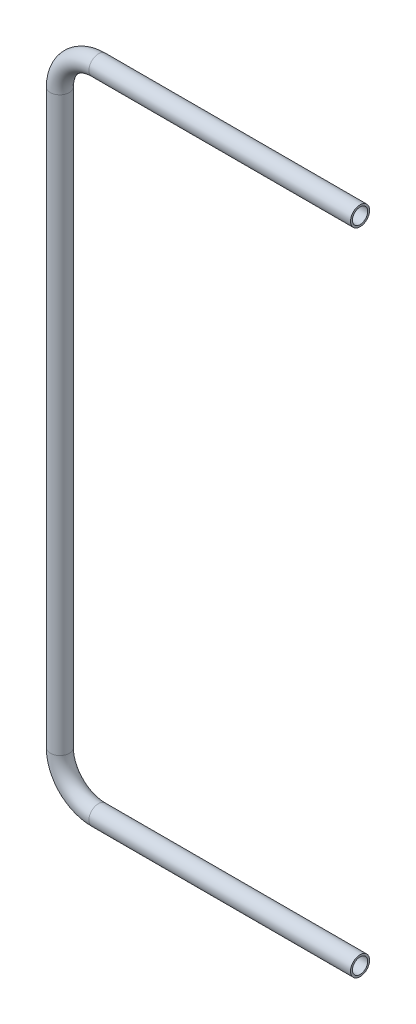
ISO-10303-21;
HEADER;
FILE_DESCRIPTION(('STEP AP214'),'2;1');
FILE_NAME('part.step','',(''),(''),'','','');
FILE_SCHEMA(('AUTOMOTIVE_DESIGN { 1 0 10303 214 1 1 1 1 }'));
ENDSEC;
DATA;
#1=APPLICATION_CONTEXT('core data for automotive mechanical design processes');
#2=APPLICATION_PROTOCOL_DEFINITION('international standard','automotive_design',2000,#1);
#3=PRODUCT_CONTEXT('',#1,'mechanical');
#4=PRODUCT('Part','Part','',(#3));
#5=PRODUCT_RELATED_PRODUCT_CATEGORY('part','',(#4));
#6=PRODUCT_DEFINITION_FORMATION('','',#4);
#7=PRODUCT_DEFINITION_CONTEXT('part definition',#1,'design');
#8=PRODUCT_DEFINITION('design','',#6,#7);
#9=PRODUCT_DEFINITION_SHAPE('','',#8);
#10=(LENGTH_UNIT() NAMED_UNIT(*) SI_UNIT(.MILLI.,.METRE.));
#11=(NAMED_UNIT(*) PLANE_ANGLE_UNIT() SI_UNIT($,.RADIAN.));
#12=(NAMED_UNIT(*) SI_UNIT($,.STERADIAN.) SOLID_ANGLE_UNIT());
#13=UNCERTAINTY_MEASURE_WITH_UNIT(LENGTH_MEASURE(1.E-05),#10,'distance_accuracy_value','');
#14=(GEOMETRIC_REPRESENTATION_CONTEXT(3) GLOBAL_UNCERTAINTY_ASSIGNED_CONTEXT((#13)) GLOBAL_UNIT_ASSIGNED_CONTEXT((#10,
#11,#12)) REPRESENTATION_CONTEXT('',''));
#15=CARTESIAN_POINT('',(0.,0.,0.));
#16=DIRECTION('',(0.,0.,1.));
#17=DIRECTION('',(1.,0.,0.));
#18=AXIS2_PLACEMENT_3D('',#15,#16,#17);
#19=CARTESIAN_POINT('',(0.,0.,0.));
#20=DIRECTION('',(-1.,0.,0.));
#21=DIRECTION('',(0.,-1.,0.));
#22=AXIS2_PLACEMENT_3D('',#19,#20,#21);
#23=CYLINDRICAL_SURFACE('',#22,16.7005);
#24=CARTESIAN_POINT('',(-457.2,0.,0.));
#25=DIRECTION('',(1.,0.,0.));
#26=DIRECTION('',(0.,0.,-1.));
#27=AXIS2_PLACEMENT_3D('',#24,#25,#26);
#28=CIRCLE('',#27,16.7005);
#29=CARTESIAN_POINT('',(-457.2,-16.7005000000001,0.));
#30=VERTEX_POINT('',#29);
#31=EDGE_CURVE('E116',#30,#30,#28,.T.);
#32=ORIENTED_EDGE('',*,*,#31,.T.);
#33=EDGE_LOOP('',(#32));
#34=FACE_BOUND('',#33,.T.);
#35=CARTESIAN_POINT('',(0.,0.,0.));
#36=DIRECTION('',(1.,0.,0.));
#37=DIRECTION('',(0.,0.,-1.));
#38=AXIS2_PLACEMENT_3D('',#35,#36,#37);
#39=CIRCLE('',#38,16.7005);
#40=CARTESIAN_POINT('',(0.,0.,-16.7005));
#41=VERTEX_POINT('',#40);
#42=EDGE_CURVE('E50',#41,#41,#39,.T.);
#43=ORIENTED_EDGE('',*,*,#42,.F.);
#44=EDGE_LOOP('',(#43));
#45=FACE_BOUND('',#44,.T.);
#46=ADVANCED_FACE('F35',(#34,#45),#23,.T.);
#47=CARTESIAN_POINT('',(-457.2,67.5005,0.));
#48=DIRECTION('',(0.,0.,-1.));
#49=DIRECTION('',(-1.,0.,0.));
#50=AXIS2_PLACEMENT_3D('',#47,#48,#49);
#51=TOROIDAL_SURFACE('',#50,67.5005,16.7005);
#52=CARTESIAN_POINT('',(-524.7005,67.5005,0.));
#53=DIRECTION('',(0.,-1.,0.));
#54=DIRECTION('',(0.,0.,-1.));
#55=AXIS2_PLACEMENT_3D('',#52,#53,#54);
#56=CIRCLE('',#55,16.7005);
#57=CARTESIAN_POINT('',(-541.401,67.5005,0.));
#58=VERTEX_POINT('',#57);
#59=EDGE_CURVE('E119',#58,#58,#56,.T.);
#60=CARTESIAN_POINT('',(-457.2,67.5005,0.));
#61=DIRECTION('',(0.,0.,-1.));
#62=DIRECTION('',(-1.,0.,0.));
#63=AXIS2_PLACEMENT_3D('',#60,#61,#62);
#64=CIRCLE('',#63,84.201);
#65=EDGE_CURVE('',#30,#58,#64,.T.);
#66=ORIENTED_EDGE('',*,*,#31,.F.);
#67=ORIENTED_EDGE('',*,*,#59,.T.);
#68=ORIENTED_EDGE('',*,*,#65,.T.);
#69=ORIENTED_EDGE('',*,*,#65,.F.);
#70=EDGE_LOOP('',(#66,#68,#67,#69));
#71=FACE_BOUND('',#70,.T.);
#72=ADVANCED_FACE('F140',(#71),#51,.T.);
#73=CARTESIAN_POINT('',(-524.7005,67.5005,0.));
#74=DIRECTION('',(0.,1.,0.));
#75=DIRECTION('',(-1.,0.,0.));
#76=AXIS2_PLACEMENT_3D('',#73,#74,#75);
#77=CYLINDRICAL_SURFACE('',#76,16.7005);
#78=CARTESIAN_POINT('',(-524.7005,1067.562,0.));
#79=DIRECTION('',(0.,-1.,0.));
#80=DIRECTION('',(0.,0.,-1.));
#81=AXIS2_PLACEMENT_3D('',#78,#79,#80);
#82=CIRCLE('',#81,16.7005);
#83=CARTESIAN_POINT('',(-541.401,1067.562,0.));
#84=VERTEX_POINT('',#83);
#85=EDGE_CURVE('E121',#84,#84,#82,.T.);
#86=ORIENTED_EDGE('',*,*,#85,.T.);
#87=EDGE_LOOP('',(#86));
#88=FACE_BOUND('',#87,.T.);
#89=ORIENTED_EDGE('',*,*,#59,.F.);
#90=EDGE_LOOP('',(#89));
#91=FACE_BOUND('',#90,.T.);
#92=ADVANCED_FACE('F136',(#88,#91),#77,.T.);
#93=CARTESIAN_POINT('',(-457.2,1067.562,0.));
#94=DIRECTION('',(0.,0.,-1.));
#95=DIRECTION('',(-1.,0.,0.));
#96=AXIS2_PLACEMENT_3D('',#93,#94,#95);
#97=TOROIDAL_SURFACE('',#96,67.5005,16.7005);
#98=CARTESIAN_POINT('',(-457.2,1135.0625,0.));
#99=DIRECTION('',(-1.,0.,0.));
#100=DIRECTION('',(0.,0.,-1.));
#101=AXIS2_PLACEMENT_3D('',#98,#99,#100);
#102=CIRCLE('',#101,16.7005);
#103=CARTESIAN_POINT('',(-457.2,1151.763,0.));
#104=VERTEX_POINT('',#103);
#105=EDGE_CURVE('E39',#104,#104,#102,.T.);
#106=CARTESIAN_POINT('',(-457.2,1067.562,0.));
#107=DIRECTION('',(0.,0.,-1.));
#108=DIRECTION('',(-1.,0.,0.));
#109=AXIS2_PLACEMENT_3D('',#106,#107,#108);
#110=CIRCLE('',#109,84.201);
#111=EDGE_CURVE('',#84,#104,#110,.T.);
#112=ORIENTED_EDGE('',*,*,#85,.F.);
#113=ORIENTED_EDGE('',*,*,#105,.T.);
#114=ORIENTED_EDGE('',*,*,#111,.T.);
#115=ORIENTED_EDGE('',*,*,#111,.F.);
#116=EDGE_LOOP('',(#112,#114,#113,#115));
#117=FACE_BOUND('',#116,.T.);
#118=ADVANCED_FACE('F128',(#117),#97,.T.);
#119=CARTESIAN_POINT('',(-457.2,1135.0625,0.));
#120=DIRECTION('',(1.,0.,0.));
#121=DIRECTION('',(0.,1.,0.));
#122=AXIS2_PLACEMENT_3D('',#119,#120,#121);
#123=CYLINDRICAL_SURFACE('',#122,16.7005);
#124=CARTESIAN_POINT('',(-3.33066907387547E-13,1135.0625,0.));
#125=DIRECTION('',(-1.,0.,0.));
#126=DIRECTION('',(0.,0.,-1.));
#127=AXIS2_PLACEMENT_3D('',#124,#125,#126);
#128=CIRCLE('',#127,16.7005);
#129=CARTESIAN_POINT('',(-3.33066907387547E-13,1135.0625,-16.7005));
#130=VERTEX_POINT('',#129);
#131=EDGE_CURVE('E55',#130,#130,#128,.T.);
#132=ORIENTED_EDGE('',*,*,#131,.T.);
#133=EDGE_LOOP('',(#132));
#134=FACE_BOUND('',#133,.T.);
#135=ORIENTED_EDGE('',*,*,#105,.F.);
#136=EDGE_LOOP('',(#135));
#137=FACE_BOUND('',#136,.T.);
#138=ADVANCED_FACE('F37',(#134,#137),#123,.T.);
#139=CARTESIAN_POINT('',(0.,0.,0.));
#140=DIRECTION('',(1.,0.,0.));
#141=DIRECTION('',(0.,0.,-1.));
#142=AXIS2_PLACEMENT_3D('',#139,#140,#141);
#143=PLANE('',#142);
#144=CARTESIAN_POINT('',(0.,0.,0.));
#145=DIRECTION('',(1.,0.,0.));
#146=DIRECTION('',(0.,0.,-1.));
#147=AXIS2_PLACEMENT_3D('',#144,#145,#146);
#148=CIRCLE('',#147,13.335);
#149=CARTESIAN_POINT('',(0.,0.,-13.335));
#150=VERTEX_POINT('',#149);
#151=EDGE_CURVE('E103',#150,#150,#148,.F.);
#152=ORIENTED_EDGE('',*,*,#151,.T.);
#153=EDGE_LOOP('',(#152));
#154=FACE_BOUND('',#153,.T.);
#155=ORIENTED_EDGE('',*,*,#42,.T.);
#156=EDGE_LOOP('',(#155));
#157=FACE_BOUND('',#156,.T.);
#158=ADVANCED_FACE('F68',(#154,#157),#143,.T.);
#159=CARTESIAN_POINT('',(-3.33066907387547E-13,1135.0625,0.));
#160=DIRECTION('',(-1.,0.,0.));
#161=DIRECTION('',(0.,0.,-1.));
#162=AXIS2_PLACEMENT_3D('',#159,#160,#161);
#163=PLANE('',#162);
#164=CARTESIAN_POINT('',(-3.33066907387547E-13,1135.0625,0.));
#165=DIRECTION('',(-1.,0.,0.));
#166=DIRECTION('',(0.,0.,-1.));
#167=AXIS2_PLACEMENT_3D('',#164,#165,#166);
#168=CIRCLE('',#167,13.335);
#169=CARTESIAN_POINT('',(-3.33066907387547E-13,1135.0625,-13.335));
#170=VERTEX_POINT('',#169);
#171=EDGE_CURVE('E11',#170,#170,#168,.F.);
#172=ORIENTED_EDGE('',*,*,#171,.F.);
#173=EDGE_LOOP('',(#172));
#174=FACE_BOUND('',#173,.T.);
#175=ORIENTED_EDGE('',*,*,#131,.F.);
#176=EDGE_LOOP('',(#175));
#177=FACE_BOUND('',#176,.T.);
#178=ADVANCED_FACE('F65',(#174,#177),#163,.F.);
#179=CARTESIAN_POINT('',(0.,0.,0.));
#180=DIRECTION('',(-1.,0.,0.));
#181=DIRECTION('',(0.,-1.,0.));
#182=AXIS2_PLACEMENT_3D('',#179,#180,#181);
#183=CYLINDRICAL_SURFACE('',#182,13.335);
#184=CARTESIAN_POINT('',(-457.2,0.,0.));
#185=DIRECTION('',(1.,0.,0.));
#186=DIRECTION('',(0.,0.,-1.));
#187=AXIS2_PLACEMENT_3D('',#184,#185,#186);
#188=CIRCLE('',#187,13.335);
#189=CARTESIAN_POINT('',(-457.2,-13.3350000000001,0.));
#190=VERTEX_POINT('',#189);
#191=EDGE_CURVE('E102',#190,#190,#188,.F.);
#192=ORIENTED_EDGE('',*,*,#191,.T.);
#193=EDGE_LOOP('',(#192));
#194=FACE_BOUND('',#193,.T.);
#195=ORIENTED_EDGE('',*,*,#151,.F.);
#196=EDGE_LOOP('',(#195));
#197=FACE_BOUND('',#196,.T.);
#198=ADVANCED_FACE('F67',(#194,#197),#183,.F.);
#199=CARTESIAN_POINT('',(-457.2,67.5005,0.));
#200=DIRECTION('',(0.,0.,-1.));
#201=DIRECTION('',(-1.,0.,0.));
#202=AXIS2_PLACEMENT_3D('',#199,#200,#201);
#203=TOROIDAL_SURFACE('',#202,67.5005,13.335);
#204=CARTESIAN_POINT('',(-524.7005,67.5005,0.));
#205=DIRECTION('',(0.,-1.,0.));
#206=DIRECTION('',(0.,0.,-1.));
#207=AXIS2_PLACEMENT_3D('',#204,#205,#206);
#208=CIRCLE('',#207,13.335);
#209=CARTESIAN_POINT('',(-538.0355,67.5005,0.));
#210=VERTEX_POINT('',#209);
#211=EDGE_CURVE('E99',#210,#210,#208,.F.);
#212=CARTESIAN_POINT('',(-457.2,67.5005,0.));
#213=DIRECTION('',(0.,0.,-1.));
#214=DIRECTION('',(-1.,0.,0.));
#215=AXIS2_PLACEMENT_3D('',#212,#213,#214);
#216=CIRCLE('',#215,80.8355);
#217=EDGE_CURVE('',#190,#210,#216,.T.);
#218=ORIENTED_EDGE('',*,*,#191,.F.);
#219=ORIENTED_EDGE('',*,*,#211,.T.);
#220=ORIENTED_EDGE('',*,*,#217,.T.);
#221=ORIENTED_EDGE('',*,*,#217,.F.);
#222=EDGE_LOOP('',(#218,#220,#219,#221));
#223=FACE_BOUND('',#222,.T.);
#224=ADVANCED_FACE('F74',(#223),#203,.F.);
#225=CARTESIAN_POINT('',(-524.7005,67.5005,0.));
#226=DIRECTION('',(0.,1.,0.));
#227=DIRECTION('',(-1.,0.,0.));
#228=AXIS2_PLACEMENT_3D('',#225,#226,#227);
#229=CYLINDRICAL_SURFACE('',#228,13.335);
#230=CARTESIAN_POINT('',(-524.7005,1067.562,0.));
#231=DIRECTION('',(0.,-1.,0.));
#232=DIRECTION('',(0.,0.,-1.));
#233=AXIS2_PLACEMENT_3D('',#230,#231,#232);
#234=CIRCLE('',#233,13.335);
#235=CARTESIAN_POINT('',(-538.0355,1067.562,0.));
#236=VERTEX_POINT('',#235);
#237=EDGE_CURVE('E105',#236,#236,#234,.F.);
#238=ORIENTED_EDGE('',*,*,#237,.T.);
#239=EDGE_LOOP('',(#238));
#240=FACE_BOUND('',#239,.T.);
#241=ORIENTED_EDGE('',*,*,#211,.F.);
#242=EDGE_LOOP('',(#241));
#243=FACE_BOUND('',#242,.T.);
#244=ADVANCED_FACE('F85',(#240,#243),#229,.F.);
#245=CARTESIAN_POINT('',(-457.2,1067.562,0.));
#246=DIRECTION('',(0.,0.,-1.));
#247=DIRECTION('',(-1.,0.,0.));
#248=AXIS2_PLACEMENT_3D('',#245,#246,#247);
#249=TOROIDAL_SURFACE('',#248,67.5005,13.335);
#250=CARTESIAN_POINT('',(-457.2,1135.0625,0.));
#251=DIRECTION('',(-1.,0.,0.));
#252=DIRECTION('',(0.,0.,-1.));
#253=AXIS2_PLACEMENT_3D('',#250,#251,#252);
#254=CIRCLE('',#253,13.335);
#255=CARTESIAN_POINT('',(-457.2,1148.3975,0.));
#256=VERTEX_POINT('',#255);
#257=EDGE_CURVE('E44',#256,#256,#254,.F.);
#258=CARTESIAN_POINT('',(-457.2,1067.562,0.));
#259=DIRECTION('',(0.,0.,-1.));
#260=DIRECTION('',(-1.,0.,0.));
#261=AXIS2_PLACEMENT_3D('',#258,#259,#260);
#262=CIRCLE('',#261,80.8355);
#263=EDGE_CURVE('',#236,#256,#262,.T.);
#264=ORIENTED_EDGE('',*,*,#237,.F.);
#265=ORIENTED_EDGE('',*,*,#257,.T.);
#266=ORIENTED_EDGE('',*,*,#263,.T.);
#267=ORIENTED_EDGE('',*,*,#263,.F.);
#268=EDGE_LOOP('',(#264,#266,#265,#267));
#269=FACE_BOUND('',#268,.T.);
#270=ADVANCED_FACE('F81',(#269),#249,.F.);
#271=CARTESIAN_POINT('',(-457.2,1135.0625,0.));
#272=DIRECTION('',(1.,0.,0.));
#273=DIRECTION('',(0.,1.,0.));
#274=AXIS2_PLACEMENT_3D('',#271,#272,#273);
#275=CYLINDRICAL_SURFACE('',#274,13.335);
#276=ORIENTED_EDGE('',*,*,#171,.T.);
#277=EDGE_LOOP('',(#276));
#278=FACE_BOUND('',#277,.T.);
#279=ORIENTED_EDGE('',*,*,#257,.F.);
#280=EDGE_LOOP('',(#279));
#281=FACE_BOUND('',#280,.T.);
#282=ADVANCED_FACE('F62',(#278,#281),#275,.F.);
#283=CLOSED_SHELL('',(#46,#72,#92,#118,#138,#158,#178,#198,#224,#244,#270,#282));
#284=MANIFOLD_SOLID_BREP('B2',#283);
#285=ADVANCED_BREP_SHAPE_REPRESENTATION('',(#18,#284),#14);
#286=SHAPE_DEFINITION_REPRESENTATION(#9,#285);
ENDSEC;
END-ISO-10303-21;
